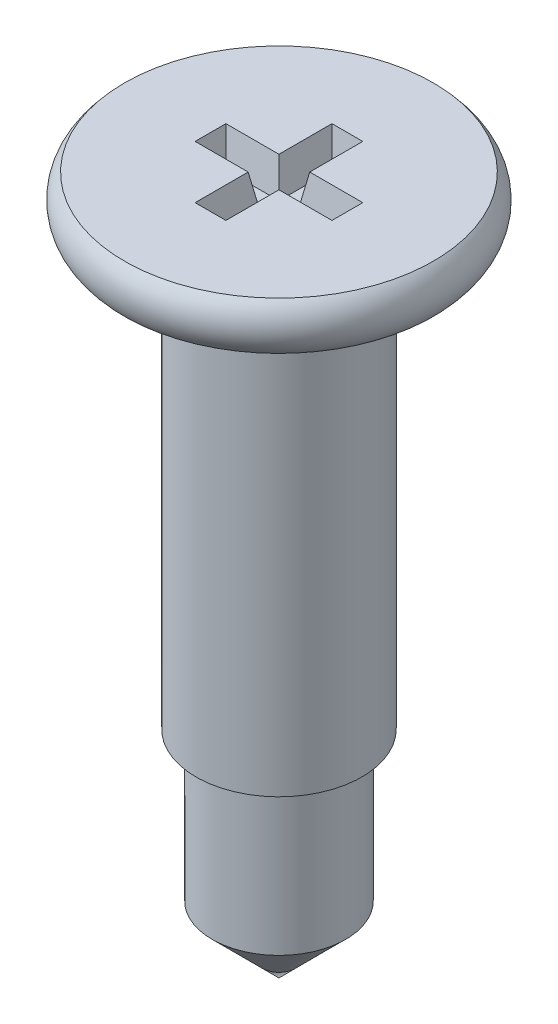
ISO-10303-21;
HEADER;
FILE_DESCRIPTION(('STEP AP214'),'2;1');
FILE_NAME('part.step','',(''),(''),'','','');
FILE_SCHEMA(('AUTOMOTIVE_DESIGN { 1 0 10303 214 1 1 1 1 }'));
ENDSEC;
DATA;
#1=APPLICATION_CONTEXT('core data for automotive mechanical design processes');
#2=APPLICATION_PROTOCOL_DEFINITION('international standard','automotive_design',2000,#1);
#3=PRODUCT_CONTEXT('',#1,'mechanical');
#4=PRODUCT('Part','Part','',(#3));
#5=PRODUCT_RELATED_PRODUCT_CATEGORY('part','',(#4));
#6=PRODUCT_DEFINITION_FORMATION('','',#4);
#7=PRODUCT_DEFINITION_CONTEXT('part definition',#1,'design');
#8=PRODUCT_DEFINITION('design','',#6,#7);
#9=PRODUCT_DEFINITION_SHAPE('','',#8);
#10=(LENGTH_UNIT() NAMED_UNIT(*) SI_UNIT(.MILLI.,.METRE.));
#11=(NAMED_UNIT(*) PLANE_ANGLE_UNIT() SI_UNIT($,.RADIAN.));
#12=(NAMED_UNIT(*) SI_UNIT($,.STERADIAN.) SOLID_ANGLE_UNIT());
#13=UNCERTAINTY_MEASURE_WITH_UNIT(LENGTH_MEASURE(1.E-05),#10,'distance_accuracy_value','');
#14=(GEOMETRIC_REPRESENTATION_CONTEXT(3) GLOBAL_UNCERTAINTY_ASSIGNED_CONTEXT((#13)) GLOBAL_UNIT_ASSIGNED_CONTEXT((#10,
#11,#12)) REPRESENTATION_CONTEXT('',''));
#15=CARTESIAN_POINT('',(0.,0.,0.));
#16=DIRECTION('',(0.,0.,1.));
#17=DIRECTION('',(1.,0.,0.));
#18=AXIS2_PLACEMENT_3D('',#15,#16,#17);
#19=CARTESIAN_POINT('',(-2.425,0.,0.));
#20=DIRECTION('',(0.,-1.,0.));
#21=DIRECTION('',(1.,0.,0.));
#22=AXIS2_PLACEMENT_3D('',#19,#20,#21);
#23=PLANE('',#22);
#24=CARTESIAN_POINT('',(0.,0.,0.));
#25=DIRECTION('',(0.,1.,0.));
#26=DIRECTION('',(-1.,0.,0.));
#27=AXIS2_PLACEMENT_3D('',#24,#25,#26);
#28=CIRCLE('',#27,2.425);
#29=CARTESIAN_POINT('',(-2.425,0.,0.));
#30=VERTEX_POINT('',#29);
#31=EDGE_CURVE('E177',#30,#30,#28,.T.);
#32=ORIENTED_EDGE('',*,*,#31,.T.);
#33=EDGE_LOOP('',(#32));
#34=FACE_BOUND('',#33,.T.);
#35=CARTESIAN_POINT('',(0.,0.,0.));
#36=DIRECTION('',(0.,1.,0.));
#37=DIRECTION('',(-1.,0.,0.));
#38=AXIS2_PLACEMENT_3D('',#35,#36,#37);
#39=CIRCLE('',#38,4.51414284285428);
#40=CARTESIAN_POINT('',(-4.51414284285429,0.,0.));
#41=VERTEX_POINT('',#40);
#42=EDGE_CURVE('E11',#41,#41,#39,.T.);
#43=ORIENTED_EDGE('',*,*,#42,.F.);
#44=EDGE_LOOP('',(#43));
#45=FACE_BOUND('',#44,.T.);
#46=ADVANCED_FACE('F34',(#34,#45),#23,.T.);
#47=CARTESIAN_POINT('',(0.,0.7,0.));
#48=DIRECTION('',(0.,1.,0.));
#49=DIRECTION('',(-1.,0.,0.));
#50=AXIS2_PLACEMENT_3D('',#47,#48,#49);
#51=TOROIDAL_SURFACE('',#50,3.8,1.);
#52=ORIENTED_EDGE('',*,*,#42,.T.);
#53=EDGE_LOOP('',(#52));
#54=FACE_BOUND('',#53,.T.);
#55=CARTESIAN_POINT('',(0.,1.4,0.));
#56=DIRECTION('',(0.,1.,0.));
#57=DIRECTION('',(-1.,0.,0.));
#58=AXIS2_PLACEMENT_3D('',#55,#56,#57);
#59=CIRCLE('',#58,4.51414284285428);
#60=CARTESIAN_POINT('',(-4.51414284285429,1.4,0.));
#61=VERTEX_POINT('',#60);
#62=EDGE_CURVE('E41',#61,#61,#59,.T.);
#63=ORIENTED_EDGE('',*,*,#62,.F.);
#64=EDGE_LOOP('',(#63));
#65=FACE_BOUND('',#64,.T.);
#66=ADVANCED_FACE('F241',(#54,#65),#51,.T.);
#67=CARTESIAN_POINT('',(-4.51414284285429,1.4,0.));
#68=DIRECTION('',(0.,1.,0.));
#69=DIRECTION('',(-1.,0.,0.));
#70=AXIS2_PLACEMENT_3D('',#67,#68,#69);
#71=PLANE('',#70);
#72=DIRECTION('',(-1.,0.,0.));
#73=VECTOR('',#72,1.);
#74=CARTESIAN_POINT('',(-0.45,1.4,-2.));
#75=LINE('',#74,#73);
#76=CARTESIAN_POINT('',(0.45,1.4,-2.));
#77=VERTEX_POINT('',#76);
#78=CARTESIAN_POINT('',(-0.45,1.4,-2.));
#79=VERTEX_POINT('',#78);
#80=EDGE_CURVE('E48',#77,#79,#75,.T.);
#81=ORIENTED_EDGE('',*,*,#80,.F.);
#82=DIRECTION('',(0.,0.,-1.));
#83=VECTOR('',#82,1.);
#84=CARTESIAN_POINT('',(0.45,1.4,-2.));
#85=LINE('',#84,#83);
#86=CARTESIAN_POINT('',(0.45,1.4,-0.45));
#87=VERTEX_POINT('',#86);
#88=EDGE_CURVE('E171',#87,#77,#85,.T.);
#89=ORIENTED_EDGE('',*,*,#88,.F.);
#90=DIRECTION('',(-1.,0.,0.));
#91=VECTOR('',#90,1.);
#92=CARTESIAN_POINT('',(0.45,1.4,-0.45));
#93=LINE('',#92,#91);
#94=CARTESIAN_POINT('',(2.,1.4,-0.45));
#95=VERTEX_POINT('',#94);
#96=EDGE_CURVE('E168',#95,#87,#93,.T.);
#97=ORIENTED_EDGE('',*,*,#96,.F.);
#98=DIRECTION('',(0.,0.,-1.));
#99=VECTOR('',#98,1.);
#100=CARTESIAN_POINT('',(2.,1.4,0.45));
#101=LINE('',#100,#99);
#102=CARTESIAN_POINT('',(2.,1.4,0.45));
#103=VERTEX_POINT('',#102);
#104=EDGE_CURVE('E165',#103,#95,#101,.T.);
#105=ORIENTED_EDGE('',*,*,#104,.F.);
#106=DIRECTION('',(1.,0.,0.));
#107=VECTOR('',#106,1.);
#108=CARTESIAN_POINT('',(0.45,1.4,0.45));
#109=LINE('',#108,#107);
#110=CARTESIAN_POINT('',(0.45,1.4,0.45));
#111=VERTEX_POINT('',#110);
#112=EDGE_CURVE('E162',#111,#103,#109,.T.);
#113=ORIENTED_EDGE('',*,*,#112,.F.);
#114=DIRECTION('',(0.,0.,-1.));
#115=VECTOR('',#114,1.);
#116=CARTESIAN_POINT('',(0.45,1.4,2.));
#117=LINE('',#116,#115);
#118=CARTESIAN_POINT('',(0.45,1.4,2.));
#119=VERTEX_POINT('',#118);
#120=EDGE_CURVE('E159',#119,#111,#117,.T.);
#121=ORIENTED_EDGE('',*,*,#120,.F.);
#122=DIRECTION('',(1.,0.,0.));
#123=VECTOR('',#122,1.);
#124=CARTESIAN_POINT('',(-0.45,1.4,2.));
#125=LINE('',#124,#123);
#126=CARTESIAN_POINT('',(-0.45,1.4,2.));
#127=VERTEX_POINT('',#126);
#128=EDGE_CURVE('E156',#127,#119,#125,.T.);
#129=ORIENTED_EDGE('',*,*,#128,.F.);
#130=DIRECTION('',(0.,0.,1.));
#131=VECTOR('',#130,1.);
#132=CARTESIAN_POINT('',(-0.45,1.4,2.));
#133=LINE('',#132,#131);
#134=CARTESIAN_POINT('',(-0.45,1.4,0.45));
#135=VERTEX_POINT('',#134);
#136=EDGE_CURVE('E153',#135,#127,#133,.T.);
#137=ORIENTED_EDGE('',*,*,#136,.F.);
#138=DIRECTION('',(1.,0.,0.));
#139=VECTOR('',#138,1.);
#140=CARTESIAN_POINT('',(-0.45,1.4,0.45));
#141=LINE('',#140,#139);
#142=CARTESIAN_POINT('',(-2.,1.4,0.45));
#143=VERTEX_POINT('',#142);
#144=EDGE_CURVE('E147',#143,#135,#141,.T.);
#145=ORIENTED_EDGE('',*,*,#144,.F.);
#146=DIRECTION('',(0.,0.,1.));
#147=VECTOR('',#146,1.);
#148=CARTESIAN_POINT('',(-2.,1.4,0.45));
#149=LINE('',#148,#147);
#150=CARTESIAN_POINT('',(-2.,1.4,-0.45));
#151=VERTEX_POINT('',#150);
#152=EDGE_CURVE('E145',#151,#143,#149,.T.);
#153=ORIENTED_EDGE('',*,*,#152,.F.);
#154=DIRECTION('',(-1.,0.,0.));
#155=VECTOR('',#154,1.);
#156=CARTESIAN_POINT('',(-0.45,1.4,-0.45));
#157=LINE('',#156,#155);
#158=CARTESIAN_POINT('',(-0.45,1.4,-0.45));
#159=VERTEX_POINT('',#158);
#160=EDGE_CURVE('E126',#159,#151,#157,.T.);
#161=ORIENTED_EDGE('',*,*,#160,.F.);
#162=DIRECTION('',(0.,0.,1.));
#163=VECTOR('',#162,1.);
#164=CARTESIAN_POINT('',(-0.45,1.4,-2.));
#165=LINE('',#164,#163);
#166=EDGE_CURVE('E137',#79,#159,#165,.T.);
#167=ORIENTED_EDGE('',*,*,#166,.F.);
#168=EDGE_LOOP('',(#81,#89,#97,#105,#113,#121,#129,#137,#145,#153,#161,#167));
#169=FACE_BOUND('',#168,.T.);
#170=ORIENTED_EDGE('',*,*,#62,.T.);
#171=EDGE_LOOP('',(#170));
#172=FACE_BOUND('',#171,.T.);
#173=ADVANCED_FACE('F141',(#169,#172),#71,.T.);
#174=CARTESIAN_POINT('',(0.,-17.05,0.));
#175=DIRECTION('',(0.,1.,0.));
#176=DIRECTION('',(-1.,0.,0.));
#177=AXIS2_PLACEMENT_3D('',#174,#175,#176);
#178=CONICAL_SURFACE('',#177,1.95,0.785398163397443);
#179=CARTESIAN_POINT('',(0.,-19.,0.));
#180=VERTEX_POINT('',#179);
#181=VERTEX_LOOP('',#180);
#182=FACE_BOUND('',#181,.T.);
#183=CARTESIAN_POINT('',(0.,-17.05,0.));
#184=DIRECTION('',(0.,1.,0.));
#185=DIRECTION('',(-1.,0.,0.));
#186=AXIS2_PLACEMENT_3D('',#183,#184,#185);
#187=CIRCLE('',#186,1.95);
#188=CARTESIAN_POINT('',(-1.95,-17.05,0.));
#189=VERTEX_POINT('',#188);
#190=EDGE_CURVE('E236',#189,#189,#187,.T.);
#191=ORIENTED_EDGE('',*,*,#190,.F.);
#192=EDGE_LOOP('',(#191));
#193=FACE_BOUND('',#192,.T.);
#194=ADVANCED_FACE('F248',(#182,#193),#178,.T.);
#195=CARTESIAN_POINT('',(0.,-19.,0.));
#196=DIRECTION('',(0.,1.,0.));
#197=DIRECTION('',(-1.,0.,0.));
#198=AXIS2_PLACEMENT_3D('',#195,#196,#197);
#199=CYLINDRICAL_SURFACE('',#198,1.95);
#200=ORIENTED_EDGE('',*,*,#190,.T.);
#201=EDGE_LOOP('',(#200));
#202=FACE_BOUND('',#201,.T.);
#203=CARTESIAN_POINT('',(0.,-12.7,0.));
#204=DIRECTION('',(0.,1.,0.));
#205=DIRECTION('',(-1.,0.,0.));
#206=AXIS2_PLACEMENT_3D('',#203,#204,#205);
#207=CIRCLE('',#206,1.95);
#208=CARTESIAN_POINT('',(-1.95,-12.7,0.));
#209=VERTEX_POINT('',#208);
#210=EDGE_CURVE('E233',#209,#209,#207,.T.);
#211=ORIENTED_EDGE('',*,*,#210,.F.);
#212=EDGE_LOOP('',(#211));
#213=FACE_BOUND('',#212,.T.);
#214=ADVANCED_FACE('F254',(#202,#213),#199,.T.);
#215=CARTESIAN_POINT('',(-2.425,-12.7,0.));
#216=DIRECTION('',(0.,-1.,0.));
#217=DIRECTION('',(1.,0.,0.));
#218=AXIS2_PLACEMENT_3D('',#215,#216,#217);
#219=PLANE('',#218);
#220=ORIENTED_EDGE('',*,*,#210,.T.);
#221=EDGE_LOOP('',(#220));
#222=FACE_BOUND('',#221,.T.);
#223=CARTESIAN_POINT('',(0.,-12.7,0.));
#224=DIRECTION('',(0.,1.,0.));
#225=DIRECTION('',(-1.,0.,0.));
#226=AXIS2_PLACEMENT_3D('',#223,#224,#225);
#227=CIRCLE('',#226,2.425);
#228=CARTESIAN_POINT('',(-2.425,-12.7,0.));
#229=VERTEX_POINT('',#228);
#230=EDGE_CURVE('E230',#229,#229,#227,.T.);
#231=ORIENTED_EDGE('',*,*,#230,.F.);
#232=EDGE_LOOP('',(#231));
#233=FACE_BOUND('',#232,.T.);
#234=ADVANCED_FACE('F257',(#222,#233),#219,.T.);
#235=CARTESIAN_POINT('',(0.,-19.,0.));
#236=DIRECTION('',(0.,1.,0.));
#237=DIRECTION('',(-1.,0.,0.));
#238=AXIS2_PLACEMENT_3D('',#235,#236,#237);
#239=CYLINDRICAL_SURFACE('',#238,2.425);
#240=ORIENTED_EDGE('',*,*,#230,.T.);
#241=EDGE_LOOP('',(#240));
#242=FACE_BOUND('',#241,.T.);
#243=ORIENTED_EDGE('',*,*,#31,.F.);
#244=EDGE_LOOP('',(#243));
#245=FACE_BOUND('',#244,.T.);
#246=ADVANCED_FACE('F261',(#242,#245),#239,.T.);
#247=CARTESIAN_POINT('',(-0.45,1.4,-2.));
#248=DIRECTION('',(0.,-0.173648177666931,-0.984807753012208));
#249=DIRECTION('',(0.,0.984807753012208,-0.173648177666931));
#250=AXIS2_PLACEMENT_3D('',#247,#248,#249);
#251=PLANE('',#250);
#252=ORIENTED_EDGE('',*,*,#80,.T.);
#253=DIRECTION('',(-0.171087869746036,0.970287525247814,-0.171087869746036));
#254=VECTOR('',#253,1.);
#255=CARTESIAN_POINT('',(-0.45,1.4,-2.));
#256=LINE('',#255,#254);
#257=CARTESIAN_POINT('',(-0.273673019291535,0.4,-1.82367301929153));
#258=VERTEX_POINT('',#257);
#259=EDGE_CURVE('E134',#258,#79,#256,.T.);
#260=ORIENTED_EDGE('',*,*,#259,.F.);
#261=DIRECTION('',(-1.,0.,0.));
#262=VECTOR('',#261,1.);
#263=CARTESIAN_POINT('',(-0.45,0.4,-1.82367301929153));
#264=LINE('',#263,#262);
#265=CARTESIAN_POINT('',(0.273673019291535,0.4,-1.82367301929153));
#266=VERTEX_POINT('',#265);
#267=EDGE_CURVE('E174',#266,#258,#264,.T.);
#268=ORIENTED_EDGE('',*,*,#267,.F.);
#269=DIRECTION('',(0.171087869746036,0.970287525247814,-0.171087869746036));
#270=VECTOR('',#269,1.);
#271=CARTESIAN_POINT('',(0.45,1.4,-2.));
#272=LINE('',#271,#270);
#273=EDGE_CURVE('E175',#266,#77,#272,.T.);
#274=ORIENTED_EDGE('',*,*,#273,.T.);
#275=EDGE_LOOP('',(#252,#260,#268,#274));
#276=FACE_BOUND('',#275,.T.);
#277=ADVANCED_FACE('F265',(#276),#251,.F.);
#278=CARTESIAN_POINT('',(0.45,1.4,-2.));
#279=DIRECTION('',(0.984807753012208,-0.173648177666931,0.));
#280=DIRECTION('',(0.173648177666931,0.984807753012208,0.));
#281=AXIS2_PLACEMENT_3D('',#278,#279,#280);
#282=PLANE('',#281);
#283=ORIENTED_EDGE('',*,*,#88,.T.);
#284=ORIENTED_EDGE('',*,*,#273,.F.);
#285=DIRECTION('',(0.,0.,-1.));
#286=VECTOR('',#285,1.);
#287=CARTESIAN_POINT('',(0.273673019291535,0.4,-2.));
#288=LINE('',#287,#286);
#289=CARTESIAN_POINT('',(0.273673019291534,0.4,-0.273673019291534));
#290=VERTEX_POINT('',#289);
#291=EDGE_CURVE('E179',#290,#266,#288,.T.);
#292=ORIENTED_EDGE('',*,*,#291,.F.);
#293=DIRECTION('',(0.171087869746036,0.970287525247814,-0.171087869746036));
#294=VECTOR('',#293,1.);
#295=CARTESIAN_POINT('',(0.495370141720066,1.65730685989049,-0.495370141720066));
#296=LINE('',#295,#294);
#297=EDGE_CURVE('E178',#290,#87,#296,.T.);
#298=ORIENTED_EDGE('',*,*,#297,.T.);
#299=EDGE_LOOP('',(#283,#284,#292,#298));
#300=FACE_BOUND('',#299,.T.);
#301=ADVANCED_FACE('F267',(#300),#282,.F.);
#302=CARTESIAN_POINT('',(0.45,1.4,-0.45));
#303=DIRECTION('',(0.,-0.173648177666931,-0.984807753012208));
#304=DIRECTION('',(0.,0.984807753012208,-0.173648177666931));
#305=AXIS2_PLACEMENT_3D('',#302,#303,#304);
#306=PLANE('',#305);
#307=ORIENTED_EDGE('',*,*,#96,.T.);
#308=ORIENTED_EDGE('',*,*,#297,.F.);
#309=DIRECTION('',(-1.,0.,0.));
#310=VECTOR('',#309,1.);
#311=CARTESIAN_POINT('',(0.45,0.4,-0.273673019291534));
#312=LINE('',#311,#310);
#313=CARTESIAN_POINT('',(1.82367301929153,0.4,-0.273673019291535));
#314=VERTEX_POINT('',#313);
#315=EDGE_CURVE('E202',#314,#290,#312,.T.);
#316=ORIENTED_EDGE('',*,*,#315,.F.);
#317=DIRECTION('',(0.171087869746036,0.970287525247814,-0.171087869746036));
#318=VECTOR('',#317,1.);
#319=CARTESIAN_POINT('',(1.97365604674319,1.25059601683778,-0.423656046743187));
#320=LINE('',#319,#318);
#321=EDGE_CURVE('E194',#314,#95,#320,.T.);
#322=ORIENTED_EDGE('',*,*,#321,.T.);
#323=EDGE_LOOP('',(#307,#308,#316,#322));
#324=FACE_BOUND('',#323,.T.);
#325=ADVANCED_FACE('F270',(#324),#306,.F.);
#326=CARTESIAN_POINT('',(2.,1.4,0.45));
#327=DIRECTION('',(0.984807753012208,-0.173648177666931,0.));
#328=DIRECTION('',(0.173648177666931,0.984807753012208,0.));
#329=AXIS2_PLACEMENT_3D('',#326,#327,#328);
#330=PLANE('',#329);
#331=ORIENTED_EDGE('',*,*,#104,.T.);
#332=ORIENTED_EDGE('',*,*,#321,.F.);
#333=DIRECTION('',(0.,0.,-1.));
#334=VECTOR('',#333,1.);
#335=CARTESIAN_POINT('',(1.82367301929153,0.4,0.45));
#336=LINE('',#335,#334);
#337=CARTESIAN_POINT('',(1.82367301929153,0.4,0.273673019291535));
#338=VERTEX_POINT('',#337);
#339=EDGE_CURVE('E205',#338,#314,#336,.T.);
#340=ORIENTED_EDGE('',*,*,#339,.F.);
#341=DIRECTION('',(0.171087869746036,0.970287525247814,0.171087869746036));
#342=VECTOR('',#341,1.);
#343=CARTESIAN_POINT('',(1.95462985827993,1.14269314010951,0.404629858279933));
#344=LINE('',#343,#342);
#345=EDGE_CURVE('E192',#338,#103,#344,.T.);
#346=ORIENTED_EDGE('',*,*,#345,.T.);
#347=EDGE_LOOP('',(#331,#332,#340,#346));
#348=FACE_BOUND('',#347,.T.);
#349=ADVANCED_FACE('F274',(#348),#330,.F.);
#350=CARTESIAN_POINT('',(0.45,1.4,0.45));
#351=DIRECTION('',(0.,-0.173648177666931,0.984807753012208));
#352=DIRECTION('',(0.,-0.984807753012208,-0.173648177666931));
#353=AXIS2_PLACEMENT_3D('',#350,#351,#352);
#354=PLANE('',#353);
#355=ORIENTED_EDGE('',*,*,#112,.T.);
#356=ORIENTED_EDGE('',*,*,#345,.F.);
#357=DIRECTION('',(1.,0.,0.));
#358=VECTOR('',#357,1.);
#359=CARTESIAN_POINT('',(0.45,0.4,0.273673019291534));
#360=LINE('',#359,#358);
#361=CARTESIAN_POINT('',(0.273673019291534,0.4,0.273673019291534));
#362=VERTEX_POINT('',#361);
#363=EDGE_CURVE('E208',#362,#338,#360,.T.);
#364=ORIENTED_EDGE('',*,*,#363,.F.);
#365=DIRECTION('',(0.171087869746036,0.970287525247814,0.171087869746036));
#366=VECTOR('',#365,1.);
#367=CARTESIAN_POINT('',(0.45,1.4,0.45));
#368=LINE('',#367,#366);
#369=EDGE_CURVE('E190',#362,#111,#368,.T.);
#370=ORIENTED_EDGE('',*,*,#369,.T.);
#371=EDGE_LOOP('',(#355,#356,#364,#370));
#372=FACE_BOUND('',#371,.T.);
#373=ADVANCED_FACE('F278',(#372),#354,.F.);
#374=CARTESIAN_POINT('',(0.45,1.4,2.));
#375=DIRECTION('',(0.984807753012208,-0.173648177666931,0.));
#376=DIRECTION('',(0.173648177666931,0.984807753012208,0.));
#377=AXIS2_PLACEMENT_3D('',#374,#375,#376);
#378=PLANE('',#377);
#379=ORIENTED_EDGE('',*,*,#120,.T.);
#380=ORIENTED_EDGE('',*,*,#369,.F.);
#381=DIRECTION('',(0.,0.,-1.));
#382=VECTOR('',#381,1.);
#383=CARTESIAN_POINT('',(0.273673019291535,0.4,2.));
#384=LINE('',#383,#382);
#385=CARTESIAN_POINT('',(0.273673019291535,0.4,1.82367301929153));
#386=VERTEX_POINT('',#385);
#387=EDGE_CURVE('E211',#386,#362,#384,.T.);
#388=ORIENTED_EDGE('',*,*,#387,.F.);
#389=DIRECTION('',(0.171087869746036,0.970287525247814,0.171087869746036));
#390=VECTOR('',#389,1.);
#391=CARTESIAN_POINT('',(0.423656046743187,1.25059601683778,1.97365604674319));
#392=LINE('',#391,#390);
#393=EDGE_CURVE('E188',#386,#119,#392,.T.);
#394=ORIENTED_EDGE('',*,*,#393,.T.);
#395=EDGE_LOOP('',(#379,#380,#388,#394));
#396=FACE_BOUND('',#395,.T.);
#397=ADVANCED_FACE('F282',(#396),#378,.F.);
#398=CARTESIAN_POINT('',(-0.45,1.4,2.));
#399=DIRECTION('',(0.,-0.173648177666931,0.984807753012208));
#400=DIRECTION('',(0.,-0.984807753012208,-0.173648177666931));
#401=AXIS2_PLACEMENT_3D('',#398,#399,#400);
#402=PLANE('',#401);
#403=ORIENTED_EDGE('',*,*,#128,.T.);
#404=ORIENTED_EDGE('',*,*,#393,.F.);
#405=DIRECTION('',(1.,0.,0.));
#406=VECTOR('',#405,1.);
#407=CARTESIAN_POINT('',(-0.45,0.4,1.82367301929153));
#408=LINE('',#407,#406);
#409=CARTESIAN_POINT('',(-0.273673019291535,0.4,1.82367301929153));
#410=VERTEX_POINT('',#409);
#411=EDGE_CURVE('E214',#410,#386,#408,.T.);
#412=ORIENTED_EDGE('',*,*,#411,.F.);
#413=DIRECTION('',(-0.171087869746036,0.970287525247814,0.171087869746036));
#414=VECTOR('',#413,1.);
#415=CARTESIAN_POINT('',(-0.45,1.4,2.));
#416=LINE('',#415,#414);
#417=EDGE_CURVE('E186',#410,#127,#416,.T.);
#418=ORIENTED_EDGE('',*,*,#417,.T.);
#419=EDGE_LOOP('',(#403,#404,#412,#418));
#420=FACE_BOUND('',#419,.T.);
#421=ADVANCED_FACE('F286',(#420),#402,.F.);
#422=CARTESIAN_POINT('',(-0.45,1.4,2.));
#423=DIRECTION('',(-0.984807753012208,-0.173648177666931,0.));
#424=DIRECTION('',(0.173648177666931,-0.984807753012208,0.));
#425=AXIS2_PLACEMENT_3D('',#422,#423,#424);
#426=PLANE('',#425);
#427=ORIENTED_EDGE('',*,*,#136,.T.);
#428=ORIENTED_EDGE('',*,*,#417,.F.);
#429=DIRECTION('',(0.,0.,1.));
#430=VECTOR('',#429,1.);
#431=CARTESIAN_POINT('',(-0.273673019291535,0.4,2.));
#432=LINE('',#431,#430);
#433=CARTESIAN_POINT('',(-0.273673019291534,0.4,0.273673019291534));
#434=VERTEX_POINT('',#433);
#435=EDGE_CURVE('E217',#434,#410,#432,.T.);
#436=ORIENTED_EDGE('',*,*,#435,.F.);
#437=DIRECTION('',(-0.171087869746036,0.970287525247814,0.171087869746036));
#438=VECTOR('',#437,1.);
#439=CARTESIAN_POINT('',(-0.495370141720067,1.65730685989049,0.495370141720066));
#440=LINE('',#439,#438);
#441=EDGE_CURVE('E184',#434,#135,#440,.T.);
#442=ORIENTED_EDGE('',*,*,#441,.T.);
#443=EDGE_LOOP('',(#427,#428,#436,#442));
#444=FACE_BOUND('',#443,.T.);
#445=ADVANCED_FACE('F290',(#444),#426,.F.);
#446=CARTESIAN_POINT('',(-0.45,1.4,0.45));
#447=DIRECTION('',(0.,-0.173648177666931,0.984807753012208));
#448=DIRECTION('',(0.,-0.984807753012208,-0.173648177666931));
#449=AXIS2_PLACEMENT_3D('',#446,#447,#448);
#450=PLANE('',#449);
#451=ORIENTED_EDGE('',*,*,#144,.T.);
#452=ORIENTED_EDGE('',*,*,#441,.F.);
#453=DIRECTION('',(1.,0.,0.));
#454=VECTOR('',#453,1.);
#455=CARTESIAN_POINT('',(-0.45,0.4,0.273673019291534));
#456=LINE('',#455,#454);
#457=CARTESIAN_POINT('',(-1.82367301929153,0.4,0.273673019291535));
#458=VERTEX_POINT('',#457);
#459=EDGE_CURVE('E220',#458,#434,#456,.T.);
#460=ORIENTED_EDGE('',*,*,#459,.F.);
#461=DIRECTION('',(-0.171087869746036,0.970287525247814,0.171087869746036));
#462=VECTOR('',#461,1.);
#463=CARTESIAN_POINT('',(-2.,1.4,0.45));
#464=LINE('',#463,#462);
#465=EDGE_CURVE('E182',#458,#143,#464,.T.);
#466=ORIENTED_EDGE('',*,*,#465,.T.);
#467=EDGE_LOOP('',(#451,#452,#460,#466));
#468=FACE_BOUND('',#467,.T.);
#469=ADVANCED_FACE('F294',(#468),#450,.F.);
#470=CARTESIAN_POINT('',(-2.,1.4,0.45));
#471=DIRECTION('',(-0.984807753012208,-0.173648177666931,0.));
#472=DIRECTION('',(0.173648177666931,-0.984807753012208,0.));
#473=AXIS2_PLACEMENT_3D('',#470,#471,#472);
#474=PLANE('',#473);
#475=ORIENTED_EDGE('',*,*,#152,.T.);
#476=ORIENTED_EDGE('',*,*,#465,.F.);
#477=DIRECTION('',(0.,0.,1.));
#478=VECTOR('',#477,1.);
#479=CARTESIAN_POINT('',(-1.82367301929153,0.4,0.45));
#480=LINE('',#479,#478);
#481=CARTESIAN_POINT('',(-1.82367301929153,0.4,-0.273673019291535));
#482=VERTEX_POINT('',#481);
#483=EDGE_CURVE('E223',#482,#458,#480,.T.);
#484=ORIENTED_EDGE('',*,*,#483,.F.);
#485=DIRECTION('',(-0.171087869746036,0.970287525247814,-0.171087869746036));
#486=VECTOR('',#485,1.);
#487=CARTESIAN_POINT('',(-1.95462985827993,1.14269314010951,-0.404629858279933));
#488=LINE('',#487,#486);
#489=EDGE_CURVE('E133',#482,#151,#488,.T.);
#490=ORIENTED_EDGE('',*,*,#489,.T.);
#491=EDGE_LOOP('',(#475,#476,#484,#490));
#492=FACE_BOUND('',#491,.T.);
#493=ADVANCED_FACE('F298',(#492),#474,.F.);
#494=CARTESIAN_POINT('',(-0.45,1.4,-0.45));
#495=DIRECTION('',(0.,-0.173648177666931,-0.984807753012208));
#496=DIRECTION('',(0.,0.984807753012208,-0.173648177666931));
#497=AXIS2_PLACEMENT_3D('',#494,#495,#496);
#498=PLANE('',#497);
#499=ORIENTED_EDGE('',*,*,#160,.T.);
#500=ORIENTED_EDGE('',*,*,#489,.F.);
#501=DIRECTION('',(-1.,0.,0.));
#502=VECTOR('',#501,1.);
#503=CARTESIAN_POINT('',(-0.45,0.4,-0.273673019291534));
#504=LINE('',#503,#502);
#505=CARTESIAN_POINT('',(-0.273673019291534,0.4,-0.273673019291534));
#506=VERTEX_POINT('',#505);
#507=EDGE_CURVE('E129',#506,#482,#504,.T.);
#508=ORIENTED_EDGE('',*,*,#507,.F.);
#509=DIRECTION('',(-0.171087869746036,0.970287525247814,-0.171087869746036));
#510=VECTOR('',#509,1.);
#511=CARTESIAN_POINT('',(-0.45,1.4,-0.45));
#512=LINE('',#511,#510);
#513=EDGE_CURVE('E122',#506,#159,#512,.T.);
#514=ORIENTED_EDGE('',*,*,#513,.T.);
#515=EDGE_LOOP('',(#499,#500,#508,#514));
#516=FACE_BOUND('',#515,.T.);
#517=ADVANCED_FACE('F124',(#516),#498,.F.);
#518=CARTESIAN_POINT('',(-0.45,1.4,-2.));
#519=DIRECTION('',(-0.984807753012208,-0.173648177666931,0.));
#520=DIRECTION('',(0.173648177666931,-0.984807753012208,0.));
#521=AXIS2_PLACEMENT_3D('',#518,#519,#520);
#522=PLANE('',#521);
#523=ORIENTED_EDGE('',*,*,#166,.T.);
#524=ORIENTED_EDGE('',*,*,#513,.F.);
#525=DIRECTION('',(0.,0.,1.));
#526=VECTOR('',#525,1.);
#527=CARTESIAN_POINT('',(-0.273673019291535,0.4,-2.));
#528=LINE('',#527,#526);
#529=EDGE_CURVE('E199',#258,#506,#528,.T.);
#530=ORIENTED_EDGE('',*,*,#529,.F.);
#531=ORIENTED_EDGE('',*,*,#259,.T.);
#532=EDGE_LOOP('',(#523,#524,#530,#531));
#533=FACE_BOUND('',#532,.T.);
#534=ADVANCED_FACE('F138',(#533),#522,.F.);
#535=CARTESIAN_POINT('',(0.,0.4,0.));
#536=DIRECTION('',(0.,-1.,0.));
#537=DIRECTION('',(0.,0.,-1.));
#538=AXIS2_PLACEMENT_3D('',#535,#536,#537);
#539=PLANE('',#538);
#540=ORIENTED_EDGE('',*,*,#267,.T.);
#541=ORIENTED_EDGE('',*,*,#529,.T.);
#542=ORIENTED_EDGE('',*,*,#507,.T.);
#543=ORIENTED_EDGE('',*,*,#483,.T.);
#544=ORIENTED_EDGE('',*,*,#459,.T.);
#545=ORIENTED_EDGE('',*,*,#435,.T.);
#546=ORIENTED_EDGE('',*,*,#411,.T.);
#547=ORIENTED_EDGE('',*,*,#387,.T.);
#548=ORIENTED_EDGE('',*,*,#363,.T.);
#549=ORIENTED_EDGE('',*,*,#339,.T.);
#550=ORIENTED_EDGE('',*,*,#315,.T.);
#551=ORIENTED_EDGE('',*,*,#291,.T.);
#552=EDGE_LOOP('',(#540,#541,#542,#543,#544,#545,#546,#547,#548,#549,#550,#551));
#553=FACE_BOUND('',#552,.T.);
#554=ADVANCED_FACE('F307',(#553),#539,.F.);
#555=CLOSED_SHELL('',(#46,#66,#173,#194,#214,#234,#246,#277,#301,#325,#349,#373,#397,#421,#445,
#469,#493,#517,#534,#554));
#556=MANIFOLD_SOLID_BREP('B2',#555);
#557=ADVANCED_BREP_SHAPE_REPRESENTATION('',(#18,#556),#14);
#558=SHAPE_DEFINITION_REPRESENTATION(#9,#557);
ENDSEC;
END-ISO-10303-21;
